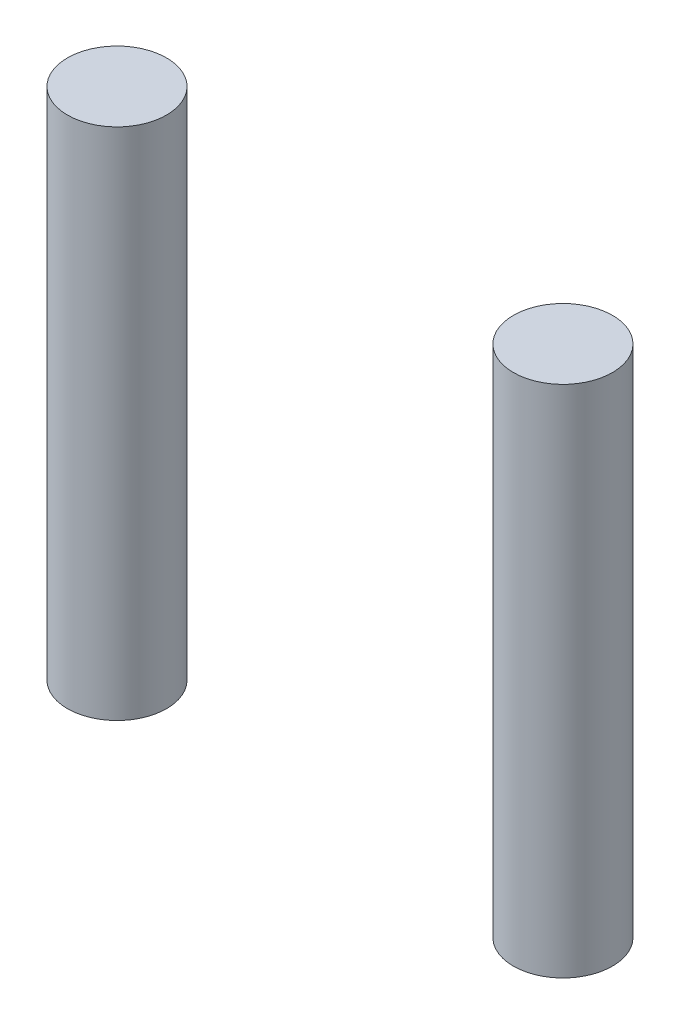
ISO-10303-21;
HEADER;
FILE_DESCRIPTION(('STEP AP214'),'2;1');
FILE_NAME('part.step','',(''),(''),'','','');
FILE_SCHEMA(('AUTOMOTIVE_DESIGN { 1 0 10303 214 1 1 1 1 }'));
ENDSEC;
DATA;
#1=APPLICATION_CONTEXT('core data for automotive mechanical design processes');
#2=APPLICATION_PROTOCOL_DEFINITION('international standard','automotive_design',2000,#1);
#3=PRODUCT_CONTEXT('',#1,'mechanical');
#4=PRODUCT('Part','Part','',(#3));
#5=PRODUCT_RELATED_PRODUCT_CATEGORY('part','',(#4));
#6=PRODUCT_DEFINITION_FORMATION('','',#4);
#7=PRODUCT_DEFINITION_CONTEXT('part definition',#1,'design');
#8=PRODUCT_DEFINITION('design','',#6,#7);
#9=PRODUCT_DEFINITION_SHAPE('','',#8);
#10=(LENGTH_UNIT() NAMED_UNIT(*) SI_UNIT(.MILLI.,.METRE.));
#11=(NAMED_UNIT(*) PLANE_ANGLE_UNIT() SI_UNIT($,.RADIAN.));
#12=(NAMED_UNIT(*) SI_UNIT($,.STERADIAN.) SOLID_ANGLE_UNIT());
#13=UNCERTAINTY_MEASURE_WITH_UNIT(LENGTH_MEASURE(1.E-05),#10,'distance_accuracy_value','');
#14=(GEOMETRIC_REPRESENTATION_CONTEXT(3) GLOBAL_UNCERTAINTY_ASSIGNED_CONTEXT((#13)) GLOBAL_UNIT_ASSIGNED_CONTEXT((#10,
#11,#12)) REPRESENTATION_CONTEXT('',''));
#15=CARTESIAN_POINT('',(0.,0.,0.));
#16=DIRECTION('',(0.,0.,1.));
#17=DIRECTION('',(1.,0.,0.));
#18=AXIS2_PLACEMENT_3D('',#15,#16,#17);
#19=CARTESIAN_POINT('',(22.5,51.88,0.));
#20=DIRECTION('',(0.,-1.,0.));
#21=DIRECTION('',(0.,0.,-1.));
#22=AXIS2_PLACEMENT_3D('',#19,#20,#21);
#23=CYLINDRICAL_SURFACE('',#22,5.);
#24=CARTESIAN_POINT('',(22.5,51.88,0.));
#25=DIRECTION('',(0.,1.,0.));
#26=DIRECTION('',(0.,0.,1.));
#27=AXIS2_PLACEMENT_3D('',#24,#25,#26);
#28=CIRCLE('',#27,5.);
#29=CARTESIAN_POINT('',(22.5,51.88,5.00000000000001));
#30=VERTEX_POINT('',#29);
#31=EDGE_CURVE('E11',#30,#30,#28,.T.);
#32=ORIENTED_EDGE('',*,*,#31,.F.);
#33=EDGE_LOOP('',(#32));
#34=FACE_BOUND('',#33,.T.);
#35=CARTESIAN_POINT('',(22.5,0.,0.));
#36=DIRECTION('',(0.,1.,0.));
#37=DIRECTION('',(0.,0.,1.));
#38=AXIS2_PLACEMENT_3D('',#35,#36,#37);
#39=CIRCLE('',#38,5.);
#40=CARTESIAN_POINT('',(22.5,0.,5.00000000000001));
#41=VERTEX_POINT('',#40);
#42=EDGE_CURVE('E41',#41,#41,#39,.T.);
#43=ORIENTED_EDGE('',*,*,#42,.T.);
#44=EDGE_LOOP('',(#43));
#45=FACE_BOUND('',#44,.T.);
#46=ADVANCED_FACE('F38',(#34,#45),#23,.T.);
#47=CARTESIAN_POINT('',(22.5,51.88,0.));
#48=DIRECTION('',(0.,1.,0.));
#49=DIRECTION('',(0.,0.,1.));
#50=AXIS2_PLACEMENT_3D('',#47,#48,#49);
#51=PLANE('',#50);
#52=ORIENTED_EDGE('',*,*,#31,.T.);
#53=EDGE_LOOP('',(#52));
#54=FACE_BOUND('',#53,.T.);
#55=ADVANCED_FACE('F53',(#54),#51,.T.);
#56=CARTESIAN_POINT('',(22.5,0.,0.));
#57=DIRECTION('',(0.,1.,0.));
#58=DIRECTION('',(0.,0.,1.));
#59=AXIS2_PLACEMENT_3D('',#56,#57,#58);
#60=PLANE('',#59);
#61=ORIENTED_EDGE('',*,*,#42,.F.);
#62=EDGE_LOOP('',(#61));
#63=FACE_BOUND('',#62,.T.);
#64=ADVANCED_FACE('F51',(#63),#60,.F.);
#65=CLOSED_SHELL('',(#46,#55,#64));
#66=MANIFOLD_SOLID_BREP('B2',#65);
#67=CARTESIAN_POINT('',(-22.5,51.88,0.));
#68=DIRECTION('',(0.,-1.,0.));
#69=DIRECTION('',(0.,0.,-1.));
#70=AXIS2_PLACEMENT_3D('',#67,#68,#69);
#71=CYLINDRICAL_SURFACE('',#70,5.);
#72=CARTESIAN_POINT('',(-22.5,51.88,0.));
#73=DIRECTION('',(0.,1.,0.));
#74=DIRECTION('',(0.,0.,1.));
#75=AXIS2_PLACEMENT_3D('',#72,#73,#74);
#76=CIRCLE('',#75,5.);
#77=CARTESIAN_POINT('',(-22.5,51.88,5.00000000000002));
#78=VERTEX_POINT('',#77);
#79=EDGE_CURVE('E37',#78,#78,#76,.T.);
#80=ORIENTED_EDGE('',*,*,#79,.F.);
#81=EDGE_LOOP('',(#80));
#82=FACE_BOUND('',#81,.T.);
#83=CARTESIAN_POINT('',(-22.5,0.,0.));
#84=DIRECTION('',(0.,1.,0.));
#85=DIRECTION('',(0.,0.,1.));
#86=AXIS2_PLACEMENT_3D('',#83,#84,#85);
#87=CIRCLE('',#86,5.);
#88=CARTESIAN_POINT('',(-22.5,0.,5.00000000000002));
#89=VERTEX_POINT('',#88);
#90=EDGE_CURVE('E81',#89,#89,#87,.T.);
#91=ORIENTED_EDGE('',*,*,#90,.T.);
#92=EDGE_LOOP('',(#91));
#93=FACE_BOUND('',#92,.T.);
#94=ADVANCED_FACE('F78',(#82,#93),#71,.T.);
#95=CARTESIAN_POINT('',(-22.5,51.88,0.));
#96=DIRECTION('',(0.,1.,0.));
#97=DIRECTION('',(0.,0.,1.));
#98=AXIS2_PLACEMENT_3D('',#95,#96,#97);
#99=PLANE('',#98);
#100=ORIENTED_EDGE('',*,*,#79,.T.);
#101=EDGE_LOOP('',(#100));
#102=FACE_BOUND('',#101,.T.);
#103=ADVANCED_FACE('F93',(#102),#99,.T.);
#104=CARTESIAN_POINT('',(-22.5,0.,0.));
#105=DIRECTION('',(0.,1.,0.));
#106=DIRECTION('',(0.,0.,1.));
#107=AXIS2_PLACEMENT_3D('',#104,#105,#106);
#108=PLANE('',#107);
#109=ORIENTED_EDGE('',*,*,#90,.F.);
#110=EDGE_LOOP('',(#109));
#111=FACE_BOUND('',#110,.T.);
#112=ADVANCED_FACE('F91',(#111),#108,.F.);
#113=CLOSED_SHELL('',(#94,#103,#112));
#114=MANIFOLD_SOLID_BREP('B6',#113);
#115=ADVANCED_BREP_SHAPE_REPRESENTATION('',(#18,#66,#114),#14);
#116=SHAPE_DEFINITION_REPRESENTATION(#9,#115);
ENDSEC;
END-ISO-10303-21;
